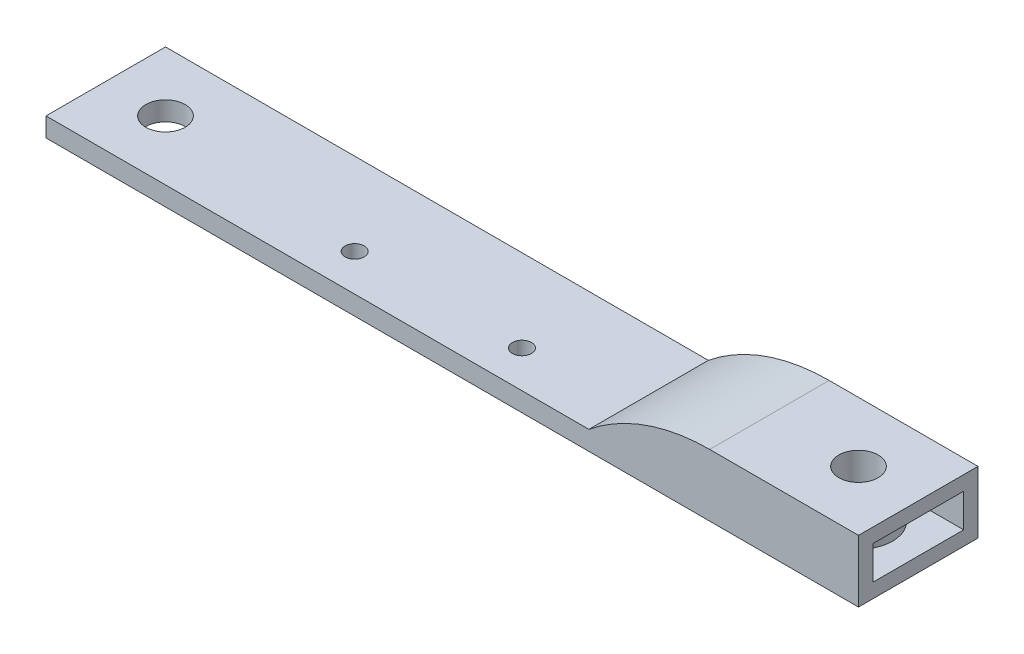
ISO-10303-21;
HEADER;
FILE_DESCRIPTION(('STEP AP214'),'2;1');
FILE_NAME('part.step','',(''),(''),'','','');
FILE_SCHEMA(('AUTOMOTIVE_DESIGN { 1 0 10303 214 1 1 1 1 }'));
ENDSEC;
DATA;
#1=APPLICATION_CONTEXT('core data for automotive mechanical design processes');
#2=APPLICATION_PROTOCOL_DEFINITION('international standard','automotive_design',2000,#1);
#3=PRODUCT_CONTEXT('',#1,'mechanical');
#4=PRODUCT('Part','Part','',(#3));
#5=PRODUCT_RELATED_PRODUCT_CATEGORY('part','',(#4));
#6=PRODUCT_DEFINITION_FORMATION('','',#4);
#7=PRODUCT_DEFINITION_CONTEXT('part definition',#1,'design');
#8=PRODUCT_DEFINITION('design','',#6,#7);
#9=PRODUCT_DEFINITION_SHAPE('','',#8);
#10=(LENGTH_UNIT() NAMED_UNIT(*) SI_UNIT(.MILLI.,.METRE.));
#11=(NAMED_UNIT(*) PLANE_ANGLE_UNIT() SI_UNIT($,.RADIAN.));
#12=(NAMED_UNIT(*) SI_UNIT($,.STERADIAN.) SOLID_ANGLE_UNIT());
#13=UNCERTAINTY_MEASURE_WITH_UNIT(LENGTH_MEASURE(1.E-05),#10,'distance_accuracy_value','');
#14=(GEOMETRIC_REPRESENTATION_CONTEXT(3) GLOBAL_UNCERTAINTY_ASSIGNED_CONTEXT((#13)) GLOBAL_UNIT_ASSIGNED_CONTEXT((#10,
#11,#12)) REPRESENTATION_CONTEXT('',''));
#15=CARTESIAN_POINT('',(0.,0.,0.));
#16=DIRECTION('',(0.,0.,1.));
#17=DIRECTION('',(1.,0.,0.));
#18=AXIS2_PLACEMENT_3D('',#15,#16,#17);
#19=CARTESIAN_POINT('',(85.,4.,0.));
#20=DIRECTION('',(1.,0.,0.));
#21=DIRECTION('',(0.,0.,-1.));
#22=AXIS2_PLACEMENT_3D('',#19,#20,#21);
#23=PLANE('',#22);
#24=DIRECTION('',(0.,0.,1.));
#25=VECTOR('',#24,1.);
#26=CARTESIAN_POINT('',(85.,0.,0.));
#27=LINE('',#26,#25);
#28=CARTESIAN_POINT('',(85.,0.,-12.5));
#29=VERTEX_POINT('',#28);
#30=CARTESIAN_POINT('',(85.,0.,12.5));
#31=VERTEX_POINT('',#30);
#32=EDGE_CURVE('E223',#29,#31,#27,.T.);
#33=ORIENTED_EDGE('',*,*,#32,.F.);
#34=DIRECTION('',(0.,-1.,0.));
#35=VECTOR('',#34,1.);
#36=CARTESIAN_POINT('',(85.,4.,-12.5));
#37=LINE('',#36,#35);
#38=CARTESIAN_POINT('',(85.,13.,-12.5));
#39=VERTEX_POINT('',#38);
#40=EDGE_CURVE('E229',#39,#29,#37,.T.);
#41=ORIENTED_EDGE('',*,*,#40,.F.);
#42=DIRECTION('',(0.,0.,-1.));
#43=VECTOR('',#42,1.);
#44=CARTESIAN_POINT('',(85.,13.,12.5));
#45=LINE('',#44,#43);
#46=CARTESIAN_POINT('',(85.,13.,12.5));
#47=VERTEX_POINT('',#46);
#48=EDGE_CURVE('E181',#47,#39,#45,.T.);
#49=ORIENTED_EDGE('',*,*,#48,.F.);
#50=DIRECTION('',(0.,-1.,0.));
#51=VECTOR('',#50,1.);
#52=CARTESIAN_POINT('',(85.,4.,12.5));
#53=LINE('',#52,#51);
#54=EDGE_CURVE('E231',#47,#31,#53,.T.);
#55=ORIENTED_EDGE('',*,*,#54,.T.);
#56=EDGE_LOOP('',(#33,#41,#49,#55));
#57=FACE_BOUND('',#56,.T.);
#58=DIRECTION('',(0.,-1.,0.));
#59=VECTOR('',#58,1.);
#60=CARTESIAN_POINT('',(85.,4.,-9.5));
#61=LINE('',#60,#59);
#62=CARTESIAN_POINT('',(85.,10.,-9.5));
#63=VERTEX_POINT('',#62);
#64=CARTESIAN_POINT('',(85.,3.,-9.5));
#65=VERTEX_POINT('',#64);
#66=EDGE_CURVE('E161',#63,#65,#61,.T.);
#67=ORIENTED_EDGE('',*,*,#66,.T.);
#68=DIRECTION('',(0.,0.,1.));
#69=VECTOR('',#68,1.);
#70=CARTESIAN_POINT('',(85.,3.,0.));
#71=LINE('',#70,#69);
#72=CARTESIAN_POINT('',(85.,3.,9.5));
#73=VERTEX_POINT('',#72);
#74=EDGE_CURVE('E155',#65,#73,#71,.T.);
#75=ORIENTED_EDGE('',*,*,#74,.T.);
#76=DIRECTION('',(0.,-1.,0.));
#77=VECTOR('',#76,1.);
#78=CARTESIAN_POINT('',(85.,4.,9.5));
#79=LINE('',#78,#77);
#80=CARTESIAN_POINT('',(85.,10.,9.5));
#81=VERTEX_POINT('',#80);
#82=EDGE_CURVE('E143',#81,#73,#79,.T.);
#83=ORIENTED_EDGE('',*,*,#82,.F.);
#84=DIRECTION('',(0.,0.,-1.));
#85=VECTOR('',#84,1.);
#86=CARTESIAN_POINT('',(85.,10.,0.));
#87=LINE('',#86,#85);
#88=EDGE_CURVE('E65',#81,#63,#87,.T.);
#89=ORIENTED_EDGE('',*,*,#88,.T.);
#90=EDGE_LOOP('',(#67,#75,#83,#89));
#91=FACE_BOUND('',#90,.T.);
#92=ADVANCED_FACE('F50',(#57,#91),#23,.T.);
#93=CARTESIAN_POINT('',(0.,4.,12.5));
#94=DIRECTION('',(0.,0.,-1.));
#95=DIRECTION('',(-1.,0.,0.));
#96=AXIS2_PLACEMENT_3D('',#93,#94,#95);
#97=PLANE('',#96);
#98=DIRECTION('',(1.,0.,0.));
#99=VECTOR('',#98,1.);
#100=CARTESIAN_POINT('',(28.5855277432255,13.,12.5));
#101=LINE('',#100,#99);
#102=CARTESIAN_POINT('',(53.8639770627546,13.,12.5));
#103=VERTEX_POINT('',#102);
#104=EDGE_CURVE('E179',#103,#47,#101,.T.);
#105=ORIENTED_EDGE('',*,*,#104,.F.);
#106=CARTESIAN_POINT('',(53.8639770627546,-27.,12.5));
#107=DIRECTION('',(0.,0.,-1.));
#108=DIRECTION('',(-1.,0.,0.));
#109=AXIS2_PLACEMENT_3D('',#106,#107,#108);
#110=CIRCLE('',#109,40.);
#111=CARTESIAN_POINT('',(28.5855277432255,4.,12.5));
#112=VERTEX_POINT('',#111);
#113=EDGE_CURVE('E58',#103,#112,#110,.F.);
#114=ORIENTED_EDGE('',*,*,#113,.T.);
#115=DIRECTION('',(1.,0.,0.));
#116=VECTOR('',#115,1.);
#117=CARTESIAN_POINT('',(0.,4.,12.5));
#118=LINE('',#117,#116);
#119=CARTESIAN_POINT('',(-85.,4.,12.5));
#120=VERTEX_POINT('',#119);
#121=EDGE_CURVE('E202',#120,#112,#118,.T.);
#122=ORIENTED_EDGE('',*,*,#121,.F.);
#123=DIRECTION('',(0.,-1.,0.));
#124=VECTOR('',#123,1.);
#125=CARTESIAN_POINT('',(-85.,4.,12.5));
#126=LINE('',#125,#124);
#127=CARTESIAN_POINT('',(-85.,0.,12.5));
#128=VERTEX_POINT('',#127);
#129=EDGE_CURVE('E233',#120,#128,#126,.T.);
#130=ORIENTED_EDGE('',*,*,#129,.T.);
#131=DIRECTION('',(1.,0.,0.));
#132=VECTOR('',#131,1.);
#133=CARTESIAN_POINT('',(0.,0.,12.5));
#134=LINE('',#133,#132);
#135=EDGE_CURVE('E220',#128,#31,#134,.T.);
#136=ORIENTED_EDGE('',*,*,#135,.T.);
#137=ORIENTED_EDGE('',*,*,#54,.F.);
#138=EDGE_LOOP('',(#105,#114,#122,#130,#136,#137));
#139=FACE_BOUND('',#138,.T.);
#140=ADVANCED_FACE('F239',(#139),#97,.F.);
#141=CARTESIAN_POINT('',(0.,4.,-12.5));
#142=DIRECTION('',(0.,0.,-1.));
#143=DIRECTION('',(-1.,0.,0.));
#144=AXIS2_PLACEMENT_3D('',#141,#142,#143);
#145=PLANE('',#144);
#146=DIRECTION('',(1.,0.,0.));
#147=VECTOR('',#146,1.);
#148=CARTESIAN_POINT('',(0.,4.,-12.5));
#149=LINE('',#148,#147);
#150=CARTESIAN_POINT('',(-85.,4.,-12.5));
#151=VERTEX_POINT('',#150);
#152=CARTESIAN_POINT('',(28.5855277432255,4.,-12.5));
#153=VERTEX_POINT('',#152);
#154=EDGE_CURVE('E205',#151,#153,#149,.T.);
#155=ORIENTED_EDGE('',*,*,#154,.T.);
#156=CARTESIAN_POINT('',(53.8639770627546,-27.,-12.5));
#157=DIRECTION('',(0.,0.,-1.));
#158=DIRECTION('',(-1.,0.,0.));
#159=AXIS2_PLACEMENT_3D('',#156,#157,#158);
#160=CIRCLE('',#159,40.);
#161=CARTESIAN_POINT('',(53.8639770627546,13.,-12.5));
#162=VERTEX_POINT('',#161);
#163=EDGE_CURVE('E12',#153,#162,#160,.T.);
#164=ORIENTED_EDGE('',*,*,#163,.T.);
#165=DIRECTION('',(-1.,0.,0.));
#166=VECTOR('',#165,1.);
#167=CARTESIAN_POINT('',(85.,13.,-12.5));
#168=LINE('',#167,#166);
#169=EDGE_CURVE('E176',#39,#162,#168,.T.);
#170=ORIENTED_EDGE('',*,*,#169,.F.);
#171=ORIENTED_EDGE('',*,*,#40,.T.);
#172=DIRECTION('',(1.,0.,0.));
#173=VECTOR('',#172,1.);
#174=CARTESIAN_POINT('',(0.,0.,-12.5));
#175=LINE('',#174,#173);
#176=CARTESIAN_POINT('',(-85.,0.,-12.5));
#177=VERTEX_POINT('',#176);
#178=EDGE_CURVE('E196',#177,#29,#175,.T.);
#179=ORIENTED_EDGE('',*,*,#178,.F.);
#180=DIRECTION('',(0.,-1.,0.));
#181=VECTOR('',#180,1.);
#182=CARTESIAN_POINT('',(-85.,4.,-12.5));
#183=LINE('',#182,#181);
#184=EDGE_CURVE('E208',#151,#177,#183,.T.);
#185=ORIENTED_EDGE('',*,*,#184,.F.);
#186=EDGE_LOOP('',(#155,#164,#170,#171,#179,#185));
#187=FACE_BOUND('',#186,.T.);
#188=ADVANCED_FACE('F250',(#187),#145,.T.);
#189=CARTESIAN_POINT('',(-85.,4.,0.));
#190=DIRECTION('',(1.,0.,0.));
#191=DIRECTION('',(0.,0.,-1.));
#192=AXIS2_PLACEMENT_3D('',#189,#190,#191);
#193=PLANE('',#192);
#194=DIRECTION('',(0.,0.,1.));
#195=VECTOR('',#194,1.);
#196=CARTESIAN_POINT('',(-85.,0.,0.));
#197=LINE('',#196,#195);
#198=EDGE_CURVE('E217',#177,#128,#197,.T.);
#199=ORIENTED_EDGE('',*,*,#198,.T.);
#200=ORIENTED_EDGE('',*,*,#129,.F.);
#201=DIRECTION('',(0.,0.,1.));
#202=VECTOR('',#201,1.);
#203=CARTESIAN_POINT('',(-85.,4.,0.));
#204=LINE('',#203,#202);
#205=EDGE_CURVE('E199',#151,#120,#204,.T.);
#206=ORIENTED_EDGE('',*,*,#205,.F.);
#207=ORIENTED_EDGE('',*,*,#184,.T.);
#208=EDGE_LOOP('',(#199,#200,#206,#207));
#209=FACE_BOUND('',#208,.T.);
#210=ADVANCED_FACE('F263',(#209),#193,.F.);
#211=CARTESIAN_POINT('',(-28.1584857268049,4.,4.76338253620877));
#212=DIRECTION('',(0.,-1.,0.));
#213=DIRECTION('',(0.,0.,-1.));
#214=AXIS2_PLACEMENT_3D('',#211,#212,#213);
#215=CYLINDRICAL_SURFACE('',#214,2.);
#216=CARTESIAN_POINT('',(-28.1584857268049,4.,4.76338253620877));
#217=DIRECTION('',(0.,1.,0.));
#218=DIRECTION('',(0.,0.,1.));
#219=AXIS2_PLACEMENT_3D('',#216,#217,#218);
#220=CIRCLE('',#219,2.);
#221=CARTESIAN_POINT('',(-28.1584857268049,4.,6.76338253620877));
#222=VERTEX_POINT('',#221);
#223=EDGE_CURVE('E195',#222,#222,#220,.T.);
#224=ORIENTED_EDGE('',*,*,#223,.T.);
#225=EDGE_LOOP('',(#224));
#226=FACE_BOUND('',#225,.T.);
#227=CARTESIAN_POINT('',(-28.1584857268049,0.,4.76338253620877));
#228=DIRECTION('',(0.,1.,0.));
#229=DIRECTION('',(0.,0.,1.));
#230=AXIS2_PLACEMENT_3D('',#227,#228,#229);
#231=CIRCLE('',#230,2.);
#232=CARTESIAN_POINT('',(-28.1584857268049,0.,6.76338253620877));
#233=VERTEX_POINT('',#232);
#234=EDGE_CURVE('E214',#233,#233,#231,.T.);
#235=ORIENTED_EDGE('',*,*,#234,.F.);
#236=EDGE_LOOP('',(#235));
#237=FACE_BOUND('',#236,.T.);
#238=ADVANCED_FACE('F265',(#226,#237),#215,.F.);
#239=CARTESIAN_POINT('',(6.84151427319507,4.,4.76338253620875));
#240=DIRECTION('',(0.,-1.,0.));
#241=DIRECTION('',(0.,0.,-1.));
#242=AXIS2_PLACEMENT_3D('',#239,#240,#241);
#243=CYLINDRICAL_SURFACE('',#242,2.);
#244=CARTESIAN_POINT('',(6.84151427319507,4.,4.76338253620875));
#245=DIRECTION('',(0.,1.,0.));
#246=DIRECTION('',(0.,0.,1.));
#247=AXIS2_PLACEMENT_3D('',#244,#245,#246);
#248=CIRCLE('',#247,2.);
#249=CARTESIAN_POINT('',(6.84151427319507,4.,6.76338253620875));
#250=VERTEX_POINT('',#249);
#251=EDGE_CURVE('E192',#250,#250,#248,.T.);
#252=ORIENTED_EDGE('',*,*,#251,.T.);
#253=EDGE_LOOP('',(#252));
#254=FACE_BOUND('',#253,.T.);
#255=CARTESIAN_POINT('',(6.84151427319507,0.,4.76338253620875));
#256=DIRECTION('',(0.,1.,0.));
#257=DIRECTION('',(0.,0.,1.));
#258=AXIS2_PLACEMENT_3D('',#255,#256,#257);
#259=CIRCLE('',#258,2.);
#260=CARTESIAN_POINT('',(6.84151427319507,0.,6.76338253620875));
#261=VERTEX_POINT('',#260);
#262=EDGE_CURVE('E211',#261,#261,#259,.T.);
#263=ORIENTED_EDGE('',*,*,#262,.F.);
#264=EDGE_LOOP('',(#263));
#265=FACE_BOUND('',#264,.T.);
#266=ADVANCED_FACE('F271',(#254,#265),#243,.F.);
#267=CARTESIAN_POINT('',(72.5,4.,0.));
#268=DIRECTION('',(0.,-1.,0.));
#269=DIRECTION('',(0.,0.,-1.));
#270=AXIS2_PLACEMENT_3D('',#267,#268,#269);
#271=CYLINDRICAL_SURFACE('',#270,4.125);
#272=CARTESIAN_POINT('',(72.5,0.,0.));
#273=DIRECTION('',(0.,1.,0.));
#274=DIRECTION('',(0.,0.,1.));
#275=AXIS2_PLACEMENT_3D('',#272,#273,#274);
#276=CIRCLE('',#275,4.125);
#277=CARTESIAN_POINT('',(72.5,0.,4.125));
#278=VERTEX_POINT('',#277);
#279=EDGE_CURVE('E189',#278,#278,#276,.T.);
#280=ORIENTED_EDGE('',*,*,#279,.F.);
#281=EDGE_LOOP('',(#280));
#282=FACE_BOUND('',#281,.T.);
#283=CARTESIAN_POINT('',(72.5,13.,0.));
#284=DIRECTION('',(0.,1.,0.));
#285=DIRECTION('',(0.,0.,1.));
#286=AXIS2_PLACEMENT_3D('',#283,#284,#285);
#287=CIRCLE('',#286,4.125);
#288=CARTESIAN_POINT('',(72.5,13.,4.125));
#289=VERTEX_POINT('',#288);
#290=EDGE_CURVE('E172',#289,#289,#287,.T.);
#291=ORIENTED_EDGE('',*,*,#290,.T.);
#292=EDGE_LOOP('',(#291));
#293=FACE_BOUND('',#292,.T.);
#294=ADVANCED_FACE('F284',(#282,#293),#271,.F.);
#295=CARTESIAN_POINT('',(0.,0.,0.));
#296=DIRECTION('',(0.,1.,0.));
#297=DIRECTION('',(0.,0.,1.));
#298=AXIS2_PLACEMENT_3D('',#295,#296,#297);
#299=PLANE('',#298);
#300=CARTESIAN_POINT('',(-72.5,0.,0.));
#301=DIRECTION('',(0.,1.,0.));
#302=DIRECTION('',(0.,0.,1.));
#303=AXIS2_PLACEMENT_3D('',#300,#301,#302);
#304=CIRCLE('',#303,4.125);
#305=CARTESIAN_POINT('',(-72.5,0.,4.125));
#306=VERTEX_POINT('',#305);
#307=EDGE_CURVE('E186',#306,#306,#304,.T.);
#308=ORIENTED_EDGE('',*,*,#307,.T.);
#309=EDGE_LOOP('',(#308));
#310=FACE_BOUND('',#309,.T.);
#311=ORIENTED_EDGE('',*,*,#279,.T.);
#312=EDGE_LOOP('',(#311));
#313=FACE_BOUND('',#312,.T.);
#314=ORIENTED_EDGE('',*,*,#262,.T.);
#315=EDGE_LOOP('',(#314));
#316=FACE_BOUND('',#315,.T.);
#317=ORIENTED_EDGE('',*,*,#234,.T.);
#318=EDGE_LOOP('',(#317));
#319=FACE_BOUND('',#318,.T.);
#320=ORIENTED_EDGE('',*,*,#198,.F.);
#321=ORIENTED_EDGE('',*,*,#178,.T.);
#322=ORIENTED_EDGE('',*,*,#32,.T.);
#323=ORIENTED_EDGE('',*,*,#135,.F.);
#324=EDGE_LOOP('',(#320,#321,#322,#323));
#325=FACE_BOUND('',#324,.T.);
#326=ADVANCED_FACE('F261',(#310,#313,#316,#319,#325),#299,.F.);
#327=CARTESIAN_POINT('',(0.,4.,0.));
#328=DIRECTION('',(0.,1.,0.));
#329=DIRECTION('',(0.,0.,1.));
#330=AXIS2_PLACEMENT_3D('',#327,#328,#329);
#331=PLANE('',#330);
#332=DIRECTION('',(0.,0.,1.));
#333=VECTOR('',#332,1.);
#334=CARTESIAN_POINT('',(28.5855277432255,4.,-12.5));
#335=LINE('',#334,#333);
#336=EDGE_CURVE('E175',#153,#112,#335,.T.);
#337=ORIENTED_EDGE('',*,*,#336,.F.);
#338=ORIENTED_EDGE('',*,*,#154,.F.);
#339=ORIENTED_EDGE('',*,*,#205,.T.);
#340=ORIENTED_EDGE('',*,*,#121,.T.);
#341=EDGE_LOOP('',(#337,#338,#339,#340));
#342=FACE_BOUND('',#341,.T.);
#343=CARTESIAN_POINT('',(-72.5,4.,0.));
#344=DIRECTION('',(0.,1.,0.));
#345=DIRECTION('',(0.,0.,1.));
#346=AXIS2_PLACEMENT_3D('',#343,#344,#345);
#347=CIRCLE('',#346,4.125);
#348=CARTESIAN_POINT('',(-72.5,4.,4.125));
#349=VERTEX_POINT('',#348);
#350=EDGE_CURVE('E184',#349,#349,#347,.T.);
#351=ORIENTED_EDGE('',*,*,#350,.F.);
#352=EDGE_LOOP('',(#351));
#353=FACE_BOUND('',#352,.T.);
#354=ORIENTED_EDGE('',*,*,#251,.F.);
#355=EDGE_LOOP('',(#354));
#356=FACE_BOUND('',#355,.T.);
#357=ORIENTED_EDGE('',*,*,#223,.F.);
#358=EDGE_LOOP('',(#357));
#359=FACE_BOUND('',#358,.T.);
#360=ADVANCED_FACE('F242',(#342,#353,#356,#359),#331,.T.);
#361=CARTESIAN_POINT('',(-72.5,0.,0.));
#362=DIRECTION('',(0.,1.,0.));
#363=DIRECTION('',(0.,0.,1.));
#364=AXIS2_PLACEMENT_3D('',#361,#362,#363);
#365=CYLINDRICAL_SURFACE('',#364,4.125);
#366=ORIENTED_EDGE('',*,*,#307,.F.);
#367=EDGE_LOOP('',(#366));
#368=FACE_BOUND('',#367,.T.);
#369=ORIENTED_EDGE('',*,*,#350,.T.);
#370=EDGE_LOOP('',(#369));
#371=FACE_BOUND('',#370,.T.);
#372=ADVANCED_FACE('F288',(#368,#371),#365,.F.);
#373=CARTESIAN_POINT('',(0.,13.,0.));
#374=DIRECTION('',(0.,1.,0.));
#375=DIRECTION('',(0.,0.,1.));
#376=AXIS2_PLACEMENT_3D('',#373,#374,#375);
#377=PLANE('',#376);
#378=ORIENTED_EDGE('',*,*,#169,.T.);
#379=DIRECTION('',(0.,0.,-1.));
#380=VECTOR('',#379,1.);
#381=CARTESIAN_POINT('',(53.8639770627546,13.,12.5));
#382=LINE('',#381,#380);
#383=EDGE_CURVE('E236',#162,#103,#382,.F.);
#384=ORIENTED_EDGE('',*,*,#383,.T.);
#385=ORIENTED_EDGE('',*,*,#104,.T.);
#386=ORIENTED_EDGE('',*,*,#48,.T.);
#387=EDGE_LOOP('',(#378,#384,#385,#386));
#388=FACE_BOUND('',#387,.T.);
#389=ORIENTED_EDGE('',*,*,#290,.F.);
#390=EDGE_LOOP('',(#389));
#391=FACE_BOUND('',#390,.T.);
#392=ADVANCED_FACE('F252',(#388,#391),#377,.T.);
#393=CARTESIAN_POINT('',(53.8639770627546,-27.,-12.5));
#394=DIRECTION('',(0.,0.,1.));
#395=DIRECTION('',(1.,0.,0.));
#396=AXIS2_PLACEMENT_3D('',#393,#394,#395);
#397=CYLINDRICAL_SURFACE('',#396,40.);
#398=ORIENTED_EDGE('',*,*,#163,.F.);
#399=ORIENTED_EDGE('',*,*,#336,.T.);
#400=ORIENTED_EDGE('',*,*,#113,.F.);
#401=ORIENTED_EDGE('',*,*,#383,.F.);
#402=EDGE_LOOP('',(#398,#399,#400,#401));
#403=FACE_BOUND('',#402,.T.);
#404=ADVANCED_FACE('F52',(#403),#397,.T.);
#405=CARTESIAN_POINT('',(0.,4.,9.5));
#406=DIRECTION('',(0.,0.,-1.));
#407=DIRECTION('',(-1.,0.,0.));
#408=AXIS2_PLACEMENT_3D('',#405,#406,#407);
#409=PLANE('',#408);
#410=DIRECTION('',(1.,0.,0.));
#411=VECTOR('',#410,1.);
#412=CARTESIAN_POINT('',(0.,10.,9.5));
#413=LINE('',#412,#411);
#414=CARTESIAN_POINT('',(53.8639770627546,10.,9.5));
#415=VERTEX_POINT('',#414);
#416=EDGE_CURVE('E132',#415,#81,#413,.T.);
#417=ORIENTED_EDGE('',*,*,#416,.T.);
#418=ORIENTED_EDGE('',*,*,#82,.T.);
#419=DIRECTION('',(1.,0.,0.));
#420=VECTOR('',#419,1.);
#421=CARTESIAN_POINT('',(0.,3.,9.5));
#422=LINE('',#421,#420);
#423=CARTESIAN_POINT('',(32.2075692350469,3.,9.5));
#424=VERTEX_POINT('',#423);
#425=EDGE_CURVE('E134',#424,#73,#422,.T.);
#426=ORIENTED_EDGE('',*,*,#425,.F.);
#427=CARTESIAN_POINT('',(53.8639770627546,-27.,9.5));
#428=DIRECTION('',(0.,0.,-1.));
#429=DIRECTION('',(-1.,0.,0.));
#430=AXIS2_PLACEMENT_3D('',#427,#428,#429);
#431=CIRCLE('',#430,37.);
#432=EDGE_CURVE('E128',#415,#424,#431,.F.);
#433=ORIENTED_EDGE('',*,*,#432,.F.);
#434=EDGE_LOOP('',(#417,#418,#426,#433));
#435=FACE_BOUND('',#434,.T.);
#436=ADVANCED_FACE('F130',(#435),#409,.T.);
#437=CARTESIAN_POINT('',(0.,4.,-9.5));
#438=DIRECTION('',(0.,0.,-1.));
#439=DIRECTION('',(-1.,0.,0.));
#440=AXIS2_PLACEMENT_3D('',#437,#438,#439);
#441=PLANE('',#440);
#442=DIRECTION('',(1.,0.,0.));
#443=VECTOR('',#442,1.);
#444=CARTESIAN_POINT('',(0.,3.,-9.5));
#445=LINE('',#444,#443);
#446=CARTESIAN_POINT('',(32.2075692350469,3.,-9.5));
#447=VERTEX_POINT('',#446);
#448=EDGE_CURVE('E158',#447,#65,#445,.T.);
#449=ORIENTED_EDGE('',*,*,#448,.T.);
#450=ORIENTED_EDGE('',*,*,#66,.F.);
#451=DIRECTION('',(-1.,0.,0.));
#452=VECTOR('',#451,1.);
#453=CARTESIAN_POINT('',(0.,10.,-9.5));
#454=LINE('',#453,#452);
#455=CARTESIAN_POINT('',(53.8639770627546,10.,-9.5));
#456=VERTEX_POINT('',#455);
#457=EDGE_CURVE('E147',#63,#456,#454,.T.);
#458=ORIENTED_EDGE('',*,*,#457,.T.);
#459=CARTESIAN_POINT('',(53.8639770627546,-27.,-9.5));
#460=DIRECTION('',(0.,0.,-1.));
#461=DIRECTION('',(-1.,0.,0.));
#462=AXIS2_PLACEMENT_3D('',#459,#460,#461);
#463=CIRCLE('',#462,37.);
#464=EDGE_CURVE('E136',#447,#456,#463,.T.);
#465=ORIENTED_EDGE('',*,*,#464,.F.);
#466=EDGE_LOOP('',(#449,#450,#458,#465));
#467=FACE_BOUND('',#466,.T.);
#468=ADVANCED_FACE('F305',(#467),#441,.F.);
#469=CARTESIAN_POINT('',(72.5,4.,0.));
#470=DIRECTION('',(0.,-1.,0.));
#471=DIRECTION('',(0.,0.,-1.));
#472=AXIS2_PLACEMENT_3D('',#469,#470,#471);
#473=CYLINDRICAL_SURFACE('',#472,7.125);
#474=CARTESIAN_POINT('',(72.5,3.,0.));
#475=DIRECTION('',(0.,1.,0.));
#476=DIRECTION('',(0.,0.,1.));
#477=AXIS2_PLACEMENT_3D('',#474,#475,#476);
#478=CIRCLE('',#477,7.125);
#479=CARTESIAN_POINT('',(72.5,3.,7.125));
#480=VERTEX_POINT('',#479);
#481=EDGE_CURVE('E149',#480,#480,#478,.T.);
#482=ORIENTED_EDGE('',*,*,#481,.T.);
#483=EDGE_LOOP('',(#482));
#484=FACE_BOUND('',#483,.T.);
#485=CARTESIAN_POINT('',(72.5,10.,0.));
#486=DIRECTION('',(0.,1.,0.));
#487=DIRECTION('',(0.,0.,1.));
#488=AXIS2_PLACEMENT_3D('',#485,#486,#487);
#489=CIRCLE('',#488,7.125);
#490=CARTESIAN_POINT('',(72.5,10.,7.125));
#491=VERTEX_POINT('',#490);
#492=EDGE_CURVE('E151',#491,#491,#489,.T.);
#493=ORIENTED_EDGE('',*,*,#492,.F.);
#494=EDGE_LOOP('',(#493));
#495=FACE_BOUND('',#494,.T.);
#496=ADVANCED_FACE('F301',(#484,#495),#473,.T.);
#497=CARTESIAN_POINT('',(0.,3.,0.));
#498=DIRECTION('',(0.,1.,0.));
#499=DIRECTION('',(0.,0.,1.));
#500=AXIS2_PLACEMENT_3D('',#497,#498,#499);
#501=PLANE('',#500);
#502=ORIENTED_EDGE('',*,*,#481,.F.);
#503=EDGE_LOOP('',(#502));
#504=FACE_BOUND('',#503,.T.);
#505=ORIENTED_EDGE('',*,*,#425,.T.);
#506=ORIENTED_EDGE('',*,*,#74,.F.);
#507=ORIENTED_EDGE('',*,*,#448,.F.);
#508=DIRECTION('',(0.,0.,1.));
#509=VECTOR('',#508,1.);
#510=CARTESIAN_POINT('',(32.2075692350469,3.,-12.5));
#511=LINE('',#510,#509);
#512=EDGE_CURVE('E156',#424,#447,#511,.F.);
#513=ORIENTED_EDGE('',*,*,#512,.F.);
#514=EDGE_LOOP('',(#505,#506,#507,#513));
#515=FACE_BOUND('',#514,.T.);
#516=ADVANCED_FACE('F298',(#504,#515),#501,.T.);
#517=CARTESIAN_POINT('',(0.,10.,0.));
#518=DIRECTION('',(0.,1.,0.));
#519=DIRECTION('',(0.,0.,1.));
#520=AXIS2_PLACEMENT_3D('',#517,#518,#519);
#521=PLANE('',#520);
#522=ORIENTED_EDGE('',*,*,#457,.F.);
#523=ORIENTED_EDGE('',*,*,#88,.F.);
#524=ORIENTED_EDGE('',*,*,#416,.F.);
#525=DIRECTION('',(0.,0.,1.));
#526=VECTOR('',#525,1.);
#527=CARTESIAN_POINT('',(53.8639770627546,10.,0.));
#528=LINE('',#527,#526);
#529=EDGE_CURVE('E137',#456,#415,#528,.T.);
#530=ORIENTED_EDGE('',*,*,#529,.F.);
#531=EDGE_LOOP('',(#522,#523,#524,#530));
#532=FACE_BOUND('',#531,.T.);
#533=ORIENTED_EDGE('',*,*,#492,.T.);
#534=EDGE_LOOP('',(#533));
#535=FACE_BOUND('',#534,.T.);
#536=ADVANCED_FACE('F145',(#532,#535),#521,.F.);
#537=CARTESIAN_POINT('',(53.8639770627546,-27.,-12.5));
#538=DIRECTION('',(0.,0.,1.));
#539=DIRECTION('',(1.,0.,0.));
#540=AXIS2_PLACEMENT_3D('',#537,#538,#539);
#541=CYLINDRICAL_SURFACE('',#540,37.);
#542=ORIENTED_EDGE('',*,*,#512,.T.);
#543=ORIENTED_EDGE('',*,*,#464,.T.);
#544=ORIENTED_EDGE('',*,*,#529,.T.);
#545=ORIENTED_EDGE('',*,*,#432,.T.);
#546=EDGE_LOOP('',(#542,#543,#544,#545));
#547=FACE_BOUND('',#546,.T.);
#548=ADVANCED_FACE('F140',(#547),#541,.F.);
#549=CLOSED_SHELL('',(#92,#140,#188,#210,#238,#266,#294,#326,#360,#372,#392,#404,#436,#468,#496,
#516,#536,#548));
#550=MANIFOLD_SOLID_BREP('B2',#549);
#551=ADVANCED_BREP_SHAPE_REPRESENTATION('',(#18,#550),#14);
#552=SHAPE_DEFINITION_REPRESENTATION(#9,#551);
ENDSEC;
END-ISO-10303-21;
